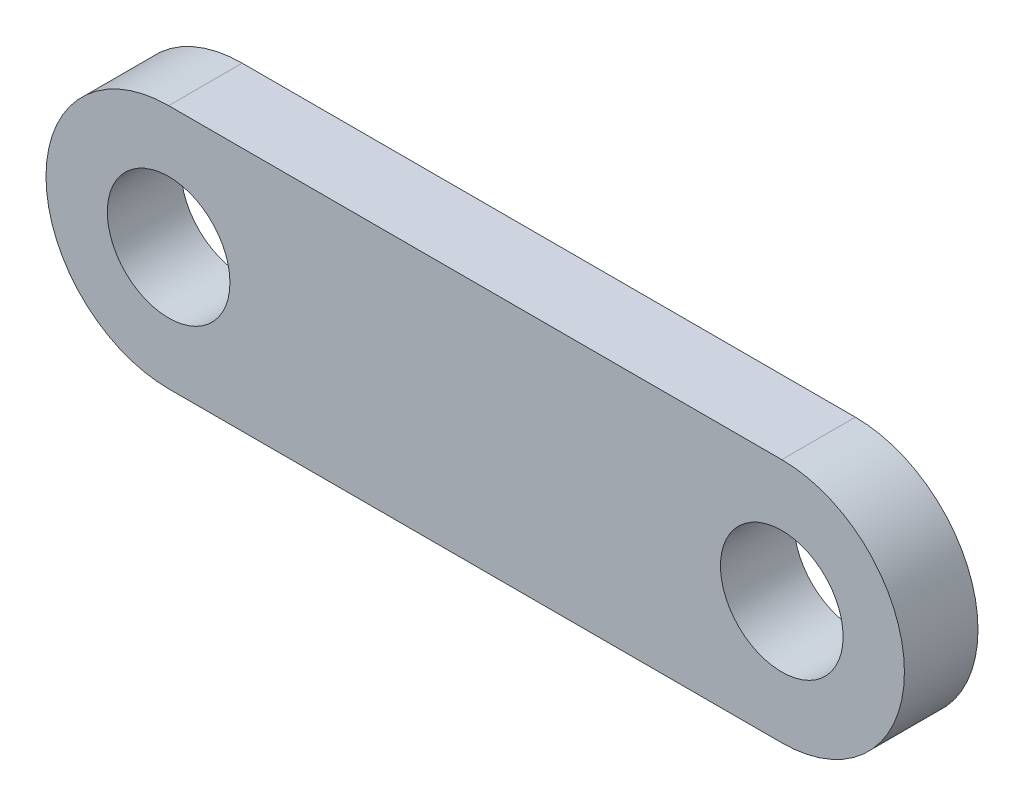
ISO-10303-21;
HEADER;
FILE_DESCRIPTION(('STEP AP214'),'2;1');
FILE_NAME('part.step','',(''),(''),'','','');
FILE_SCHEMA(('AUTOMOTIVE_DESIGN { 1 0 10303 214 1 1 1 1 }'));
ENDSEC;
DATA;
#1=APPLICATION_CONTEXT('core data for automotive mechanical design processes');
#2=APPLICATION_PROTOCOL_DEFINITION('international standard','automotive_design',2000,#1);
#3=PRODUCT_CONTEXT('',#1,'mechanical');
#4=PRODUCT('Part','Part','',(#3));
#5=PRODUCT_RELATED_PRODUCT_CATEGORY('part','',(#4));
#6=PRODUCT_DEFINITION_FORMATION('','',#4);
#7=PRODUCT_DEFINITION_CONTEXT('part definition',#1,'design');
#8=PRODUCT_DEFINITION('design','',#6,#7);
#9=PRODUCT_DEFINITION_SHAPE('','',#8);
#10=(LENGTH_UNIT() NAMED_UNIT(*) SI_UNIT(.MILLI.,.METRE.));
#11=(NAMED_UNIT(*) PLANE_ANGLE_UNIT() SI_UNIT($,.RADIAN.));
#12=(NAMED_UNIT(*) SI_UNIT($,.STERADIAN.) SOLID_ANGLE_UNIT());
#13=UNCERTAINTY_MEASURE_WITH_UNIT(LENGTH_MEASURE(1.E-05),#10,'distance_accuracy_value','');
#14=(GEOMETRIC_REPRESENTATION_CONTEXT(3) GLOBAL_UNCERTAINTY_ASSIGNED_CONTEXT((#13)) GLOBAL_UNIT_ASSIGNED_CONTEXT((#10,
#11,#12)) REPRESENTATION_CONTEXT('',''));
#15=CARTESIAN_POINT('',(0.,0.,0.));
#16=DIRECTION('',(0.,0.,1.));
#17=DIRECTION('',(1.,0.,0.));
#18=AXIS2_PLACEMENT_3D('',#15,#16,#17);
#19=CARTESIAN_POINT('',(-12.5,0.,3.));
#20=DIRECTION('',(0.,0.,1.));
#21=DIRECTION('',(1.,0.,0.));
#22=AXIS2_PLACEMENT_3D('',#19,#20,#21);
#23=PLANE('',#22);
#24=CARTESIAN_POINT('',(12.5,0.,3.));
#25=DIRECTION('',(0.,0.,1.));
#26=DIRECTION('',(1.,0.,0.));
#27=AXIS2_PLACEMENT_3D('',#24,#25,#26);
#28=CIRCLE('',#27,2.5);
#29=CARTESIAN_POINT('',(15.,0.,3.));
#30=VERTEX_POINT('',#29);
#31=EDGE_CURVE('E100',#30,#30,#28,.T.);
#32=ORIENTED_EDGE('',*,*,#31,.F.);
#33=EDGE_LOOP('',(#32));
#34=FACE_BOUND('',#33,.T.);
#35=CARTESIAN_POINT('',(-12.5,0.,3.));
#36=DIRECTION('',(0.,0.,1.));
#37=DIRECTION('',(1.,0.,0.));
#38=AXIS2_PLACEMENT_3D('',#35,#36,#37);
#39=CIRCLE('',#38,5.);
#40=CARTESIAN_POINT('',(-12.5,5.,3.));
#41=VERTEX_POINT('',#40);
#42=CARTESIAN_POINT('',(-12.5,-5.,3.));
#43=VERTEX_POINT('',#42);
#44=EDGE_CURVE('E85',#41,#43,#39,.T.);
#45=ORIENTED_EDGE('',*,*,#44,.T.);
#46=DIRECTION('',(1.,0.,0.));
#47=VECTOR('',#46,1.);
#48=CARTESIAN_POINT('',(-12.5,-5.,3.));
#49=LINE('',#48,#47);
#50=CARTESIAN_POINT('',(12.5,-5.,3.));
#51=VERTEX_POINT('',#50);
#52=EDGE_CURVE('E80',#43,#51,#49,.T.);
#53=ORIENTED_EDGE('',*,*,#52,.T.);
#54=CARTESIAN_POINT('',(12.5,0.,3.));
#55=DIRECTION('',(0.,0.,1.));
#56=DIRECTION('',(1.,0.,0.));
#57=AXIS2_PLACEMENT_3D('',#54,#55,#56);
#58=CIRCLE('',#57,5.);
#59=CARTESIAN_POINT('',(12.5,5.00000000000001,3.));
#60=VERTEX_POINT('',#59);
#61=EDGE_CURVE('E83',#51,#60,#58,.T.);
#62=ORIENTED_EDGE('',*,*,#61,.T.);
#63=DIRECTION('',(-1.,0.,0.));
#64=VECTOR('',#63,1.);
#65=CARTESIAN_POINT('',(-12.5,5.,3.));
#66=LINE('',#65,#64);
#67=EDGE_CURVE('E50',#60,#41,#66,.T.);
#68=ORIENTED_EDGE('',*,*,#67,.T.);
#69=EDGE_LOOP('',(#45,#53,#62,#68));
#70=FACE_BOUND('',#69,.T.);
#71=CARTESIAN_POINT('',(-12.5,0.,3.));
#72=DIRECTION('',(0.,0.,1.));
#73=DIRECTION('',(1.,0.,0.));
#74=AXIS2_PLACEMENT_3D('',#71,#72,#73);
#75=CIRCLE('',#74,2.5);
#76=CARTESIAN_POINT('',(-10.,0.,3.));
#77=VERTEX_POINT('',#76);
#78=EDGE_CURVE('E115',#77,#77,#75,.T.);
#79=ORIENTED_EDGE('',*,*,#78,.F.);
#80=EDGE_LOOP('',(#79));
#81=FACE_BOUND('',#80,.T.);
#82=ADVANCED_FACE('F33',(#34,#70,#81),#23,.T.);
#83=CARTESIAN_POINT('',(-12.5,0.,0.));
#84=DIRECTION('',(0.,0.,1.));
#85=DIRECTION('',(1.,0.,0.));
#86=AXIS2_PLACEMENT_3D('',#83,#84,#85);
#87=PLANE('',#86);
#88=CARTESIAN_POINT('',(-12.5,0.,0.));
#89=DIRECTION('',(0.,0.,1.));
#90=DIRECTION('',(1.,0.,0.));
#91=AXIS2_PLACEMENT_3D('',#88,#89,#90);
#92=CIRCLE('',#91,5.);
#93=CARTESIAN_POINT('',(-12.5,5.,0.));
#94=VERTEX_POINT('',#93);
#95=CARTESIAN_POINT('',(-12.5,-5.,0.));
#96=VERTEX_POINT('',#95);
#97=EDGE_CURVE('E97',#94,#96,#92,.T.);
#98=ORIENTED_EDGE('',*,*,#97,.F.);
#99=DIRECTION('',(-1.,0.,0.));
#100=VECTOR('',#99,1.);
#101=CARTESIAN_POINT('',(-12.5,5.,0.));
#102=LINE('',#101,#100);
#103=CARTESIAN_POINT('',(12.5,5.00000000000001,0.));
#104=VERTEX_POINT('',#103);
#105=EDGE_CURVE('E73',#104,#94,#102,.T.);
#106=ORIENTED_EDGE('',*,*,#105,.F.);
#107=CARTESIAN_POINT('',(12.5,0.,0.));
#108=DIRECTION('',(0.,0.,1.));
#109=DIRECTION('',(1.,0.,0.));
#110=AXIS2_PLACEMENT_3D('',#107,#108,#109);
#111=CIRCLE('',#110,5.);
#112=CARTESIAN_POINT('',(12.5,-5.,0.));
#113=VERTEX_POINT('',#112);
#114=EDGE_CURVE('E67',#113,#104,#111,.T.);
#115=ORIENTED_EDGE('',*,*,#114,.F.);
#116=DIRECTION('',(1.,0.,0.));
#117=VECTOR('',#116,1.);
#118=CARTESIAN_POINT('',(-12.5,-5.,0.));
#119=LINE('',#118,#117);
#120=EDGE_CURVE('E89',#96,#113,#119,.T.);
#121=ORIENTED_EDGE('',*,*,#120,.F.);
#122=EDGE_LOOP('',(#98,#106,#115,#121));
#123=FACE_BOUND('',#122,.T.);
#124=CARTESIAN_POINT('',(12.5,0.,0.));
#125=DIRECTION('',(0.,0.,1.));
#126=DIRECTION('',(1.,0.,0.));
#127=AXIS2_PLACEMENT_3D('',#124,#125,#126);
#128=CIRCLE('',#127,2.5);
#129=CARTESIAN_POINT('',(15.,0.,0.));
#130=VERTEX_POINT('',#129);
#131=EDGE_CURVE('E112',#130,#130,#128,.T.);
#132=ORIENTED_EDGE('',*,*,#131,.T.);
#133=EDGE_LOOP('',(#132));
#134=FACE_BOUND('',#133,.T.);
#135=CARTESIAN_POINT('',(-12.5,0.,0.));
#136=DIRECTION('',(0.,0.,1.));
#137=DIRECTION('',(1.,0.,0.));
#138=AXIS2_PLACEMENT_3D('',#135,#136,#137);
#139=CIRCLE('',#138,2.5);
#140=CARTESIAN_POINT('',(-10.,0.,0.));
#141=VERTEX_POINT('',#140);
#142=EDGE_CURVE('E118',#141,#141,#139,.T.);
#143=ORIENTED_EDGE('',*,*,#142,.T.);
#144=EDGE_LOOP('',(#143));
#145=FACE_BOUND('',#144,.T.);
#146=ADVANCED_FACE('F108',(#123,#134,#145),#87,.F.);
#147=CARTESIAN_POINT('',(-12.5,0.,3.));
#148=DIRECTION('',(0.,0.,-1.));
#149=DIRECTION('',(-1.,0.,0.));
#150=AXIS2_PLACEMENT_3D('',#147,#148,#149);
#151=CYLINDRICAL_SURFACE('',#150,5.);
#152=ORIENTED_EDGE('',*,*,#97,.T.);
#153=DIRECTION('',(0.,0.,-1.));
#154=VECTOR('',#153,1.);
#155=CARTESIAN_POINT('',(-12.5,-5.,3.));
#156=LINE('',#155,#154);
#157=EDGE_CURVE('E11',#43,#96,#156,.T.);
#158=ORIENTED_EDGE('',*,*,#157,.F.);
#159=ORIENTED_EDGE('',*,*,#44,.F.);
#160=DIRECTION('',(0.,0.,-1.));
#161=VECTOR('',#160,1.);
#162=CARTESIAN_POINT('',(-12.5,5.,3.));
#163=LINE('',#162,#161);
#164=EDGE_CURVE('E93',#41,#94,#163,.T.);
#165=ORIENTED_EDGE('',*,*,#164,.T.);
#166=EDGE_LOOP('',(#152,#158,#159,#165));
#167=FACE_BOUND('',#166,.T.);
#168=ADVANCED_FACE('F35',(#167),#151,.T.);
#169=CARTESIAN_POINT('',(-12.5,-5.,3.));
#170=DIRECTION('',(0.,1.,0.));
#171=DIRECTION('',(-1.,0.,0.));
#172=AXIS2_PLACEMENT_3D('',#169,#170,#171);
#173=PLANE('',#172);
#174=ORIENTED_EDGE('',*,*,#120,.T.);
#175=DIRECTION('',(0.,0.,-1.));
#176=VECTOR('',#175,1.);
#177=CARTESIAN_POINT('',(12.5,-5.,3.));
#178=LINE('',#177,#176);
#179=EDGE_CURVE('E42',#51,#113,#178,.T.);
#180=ORIENTED_EDGE('',*,*,#179,.F.);
#181=ORIENTED_EDGE('',*,*,#52,.F.);
#182=ORIENTED_EDGE('',*,*,#157,.T.);
#183=EDGE_LOOP('',(#174,#180,#181,#182));
#184=FACE_BOUND('',#183,.T.);
#185=ADVANCED_FACE('F88',(#184),#173,.F.);
#186=CARTESIAN_POINT('',(12.5,0.,3.));
#187=DIRECTION('',(0.,0.,-1.));
#188=DIRECTION('',(-1.,0.,0.));
#189=AXIS2_PLACEMENT_3D('',#186,#187,#188);
#190=CYLINDRICAL_SURFACE('',#189,5.);
#191=ORIENTED_EDGE('',*,*,#114,.T.);
#192=DIRECTION('',(0.,0.,-1.));
#193=VECTOR('',#192,1.);
#194=CARTESIAN_POINT('',(12.5,5.00000000000001,3.));
#195=LINE('',#194,#193);
#196=EDGE_CURVE('E90',#60,#104,#195,.T.);
#197=ORIENTED_EDGE('',*,*,#196,.F.);
#198=ORIENTED_EDGE('',*,*,#61,.F.);
#199=ORIENTED_EDGE('',*,*,#179,.T.);
#200=EDGE_LOOP('',(#191,#197,#198,#199));
#201=FACE_BOUND('',#200,.T.);
#202=ADVANCED_FACE('F91',(#201),#190,.T.);
#203=CARTESIAN_POINT('',(-12.5,5.,3.));
#204=DIRECTION('',(0.,-1.,0.));
#205=DIRECTION('',(1.,0.,0.));
#206=AXIS2_PLACEMENT_3D('',#203,#204,#205);
#207=PLANE('',#206);
#208=ORIENTED_EDGE('',*,*,#105,.T.);
#209=ORIENTED_EDGE('',*,*,#164,.F.);
#210=ORIENTED_EDGE('',*,*,#67,.F.);
#211=ORIENTED_EDGE('',*,*,#196,.T.);
#212=EDGE_LOOP('',(#208,#209,#210,#211));
#213=FACE_BOUND('',#212,.T.);
#214=ADVANCED_FACE('F105',(#213),#207,.F.);
#215=CARTESIAN_POINT('',(12.5,0.,3.));
#216=DIRECTION('',(0.,0.,-1.));
#217=DIRECTION('',(-1.,0.,0.));
#218=AXIS2_PLACEMENT_3D('',#215,#216,#217);
#219=CYLINDRICAL_SURFACE('',#218,2.5);
#220=ORIENTED_EDGE('',*,*,#31,.T.);
#221=EDGE_LOOP('',(#220));
#222=FACE_BOUND('',#221,.T.);
#223=ORIENTED_EDGE('',*,*,#131,.F.);
#224=EDGE_LOOP('',(#223));
#225=FACE_BOUND('',#224,.T.);
#226=ADVANCED_FACE('F135',(#222,#225),#219,.F.);
#227=CARTESIAN_POINT('',(-12.5,0.,3.));
#228=DIRECTION('',(0.,0.,-1.));
#229=DIRECTION('',(-1.,0.,0.));
#230=AXIS2_PLACEMENT_3D('',#227,#228,#229);
#231=CYLINDRICAL_SURFACE('',#230,2.5);
#232=ORIENTED_EDGE('',*,*,#78,.T.);
#233=EDGE_LOOP('',(#232));
#234=FACE_BOUND('',#233,.T.);
#235=ORIENTED_EDGE('',*,*,#142,.F.);
#236=EDGE_LOOP('',(#235));
#237=FACE_BOUND('',#236,.T.);
#238=ADVANCED_FACE('F124',(#234,#237),#231,.F.);
#239=CLOSED_SHELL('',(#82,#146,#168,#185,#202,#214,#226,#238));
#240=MANIFOLD_SOLID_BREP('B2',#239);
#241=ADVANCED_BREP_SHAPE_REPRESENTATION('',(#18,#240),#14);
#242=SHAPE_DEFINITION_REPRESENTATION(#9,#241);
ENDSEC;
END-ISO-10303-21;
